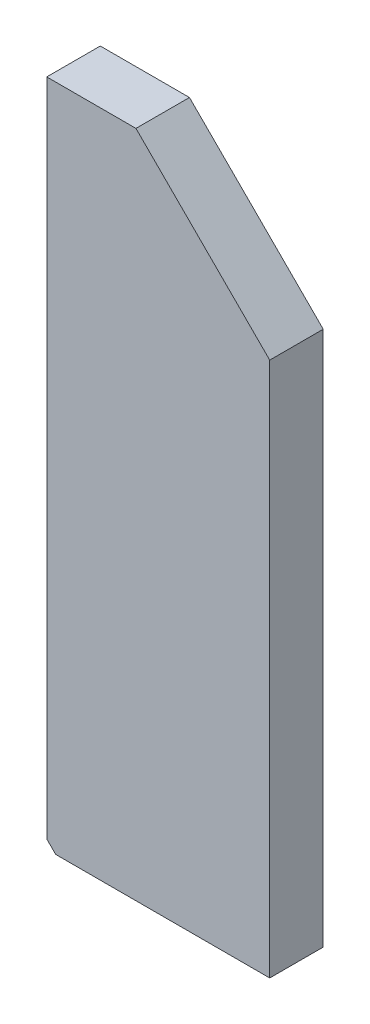
ISO-10303-21;
HEADER;
FILE_DESCRIPTION(('STEP AP214'),'2;1');
FILE_NAME('part.step','',(''),(''),'','','');
FILE_SCHEMA(('AUTOMOTIVE_DESIGN { 1 0 10303 214 1 1 1 1 }'));
ENDSEC;
DATA;
#1=APPLICATION_CONTEXT('core data for automotive mechanical design processes');
#2=APPLICATION_PROTOCOL_DEFINITION('international standard','automotive_design',2000,#1);
#3=PRODUCT_CONTEXT('',#1,'mechanical');
#4=PRODUCT('Part','Part','',(#3));
#5=PRODUCT_RELATED_PRODUCT_CATEGORY('part','',(#4));
#6=PRODUCT_DEFINITION_FORMATION('','',#4);
#7=PRODUCT_DEFINITION_CONTEXT('part definition',#1,'design');
#8=PRODUCT_DEFINITION('design','',#6,#7);
#9=PRODUCT_DEFINITION_SHAPE('','',#8);
#10=(LENGTH_UNIT() NAMED_UNIT(*) SI_UNIT(.MILLI.,.METRE.));
#11=(NAMED_UNIT(*) PLANE_ANGLE_UNIT() SI_UNIT($,.RADIAN.));
#12=(NAMED_UNIT(*) SI_UNIT($,.STERADIAN.) SOLID_ANGLE_UNIT());
#13=UNCERTAINTY_MEASURE_WITH_UNIT(LENGTH_MEASURE(1.E-05),#10,'distance_accuracy_value','');
#14=(GEOMETRIC_REPRESENTATION_CONTEXT(3) GLOBAL_UNCERTAINTY_ASSIGNED_CONTEXT((#13)) GLOBAL_UNIT_ASSIGNED_CONTEXT((#10,
#11,#12)) REPRESENTATION_CONTEXT('',''));
#15=CARTESIAN_POINT('',(0.,0.,0.));
#16=DIRECTION('',(0.,0.,1.));
#17=DIRECTION('',(1.,0.,0.));
#18=AXIS2_PLACEMENT_3D('',#15,#16,#17);
#19=CARTESIAN_POINT('',(-2.49999999999997,113.28125,12.));
#20=DIRECTION('',(-1.,0.,0.));
#21=DIRECTION('',(0.,0.,1.));
#22=AXIS2_PLACEMENT_3D('',#19,#20,#21);
#23=PLANE('',#22);
#24=DIRECTION('',(0.,1.,0.));
#25=VECTOR('',#24,1.);
#26=CARTESIAN_POINT('',(-2.49999999999997,113.28125,0.));
#27=LINE('',#26,#25);
#28=CARTESIAN_POINT('',(-2.49999999999997,-36.71875,0.));
#29=VERTEX_POINT('',#28);
#30=CARTESIAN_POINT('',(-2.49999999999997,83.2812499999999,0.));
#31=VERTEX_POINT('',#30);
#32=EDGE_CURVE('E140',#29,#31,#27,.T.);
#33=ORIENTED_EDGE('',*,*,#32,.T.);
#34=DIRECTION('',(0.,0.,1.));
#35=VECTOR('',#34,1.);
#36=CARTESIAN_POINT('',(-2.49999999999997,83.2812499999999,12.));
#37=LINE('',#36,#35);
#38=CARTESIAN_POINT('',(-2.49999999999997,83.2812499999999,12.));
#39=VERTEX_POINT('',#38);
#40=EDGE_CURVE('E169',#31,#39,#37,.T.);
#41=ORIENTED_EDGE('',*,*,#40,.T.);
#42=DIRECTION('',(0.,1.,0.));
#43=VECTOR('',#42,1.);
#44=CARTESIAN_POINT('',(-2.49999999999997,113.28125,12.));
#45=LINE('',#44,#43);
#46=CARTESIAN_POINT('',(-2.49999999999997,-36.71875,12.));
#47=VERTEX_POINT('',#46);
#48=EDGE_CURVE('E141',#47,#39,#45,.T.);
#49=ORIENTED_EDGE('',*,*,#48,.F.);
#50=DIRECTION('',(0.,0.,-1.));
#51=VECTOR('',#50,1.);
#52=CARTESIAN_POINT('',(-2.49999999999997,-36.71875,12.));
#53=LINE('',#52,#51);
#54=EDGE_CURVE('E151',#47,#29,#53,.T.);
#55=ORIENTED_EDGE('',*,*,#54,.T.);
#56=EDGE_LOOP('',(#33,#41,#49,#55));
#57=FACE_BOUND('',#56,.T.);
#58=ADVANCED_FACE('F35',(#57),#23,.F.);
#59=CARTESIAN_POINT('',(-52.5,113.28125,12.));
#60=DIRECTION('',(0.,-1.,0.));
#61=DIRECTION('',(1.,0.,0.));
#62=AXIS2_PLACEMENT_3D('',#59,#60,#61);
#63=PLANE('',#62);
#64=DIRECTION('',(-1.,0.,0.));
#65=VECTOR('',#64,1.);
#66=CARTESIAN_POINT('',(-52.5,113.28125,12.));
#67=LINE('',#66,#65);
#68=CARTESIAN_POINT('',(-32.5,113.28125,12.));
#69=VERTEX_POINT('',#68);
#70=CARTESIAN_POINT('',(-52.5,113.28125,12.));
#71=VERTEX_POINT('',#70);
#72=EDGE_CURVE('E144',#69,#71,#67,.T.);
#73=ORIENTED_EDGE('',*,*,#72,.F.);
#74=DIRECTION('',(0.,0.,-1.));
#75=VECTOR('',#74,1.);
#76=CARTESIAN_POINT('',(-32.5,113.28125,12.));
#77=LINE('',#76,#75);
#78=CARTESIAN_POINT('',(-32.5,113.28125,0.));
#79=VERTEX_POINT('',#78);
#80=EDGE_CURVE('E164',#69,#79,#77,.T.);
#81=ORIENTED_EDGE('',*,*,#80,.T.);
#82=DIRECTION('',(-1.,0.,0.));
#83=VECTOR('',#82,1.);
#84=CARTESIAN_POINT('',(-52.5,113.28125,0.));
#85=LINE('',#84,#83);
#86=CARTESIAN_POINT('',(-52.5,113.28125,0.));
#87=VERTEX_POINT('',#86);
#88=EDGE_CURVE('E154',#79,#87,#85,.T.);
#89=ORIENTED_EDGE('',*,*,#88,.T.);
#90=DIRECTION('',(0.,0.,-1.));
#91=VECTOR('',#90,1.);
#92=CARTESIAN_POINT('',(-52.5,113.28125,12.));
#93=LINE('',#92,#91);
#94=EDGE_CURVE('E161',#71,#87,#93,.T.);
#95=ORIENTED_EDGE('',*,*,#94,.F.);
#96=EDGE_LOOP('',(#73,#81,#89,#95));
#97=FACE_BOUND('',#96,.T.);
#98=ADVANCED_FACE('F198',(#97),#63,.F.);
#99=CARTESIAN_POINT('',(-52.5,113.28125,12.));
#100=DIRECTION('',(1.,0.,0.));
#101=DIRECTION('',(0.,1.,0.));
#102=AXIS2_PLACEMENT_3D('',#99,#100,#101);
#103=PLANE('',#102);
#104=CARTESIAN_POINT('',(-52.5,98.28125,6.));
#105=DIRECTION('',(-1.,0.,0.));
#106=DIRECTION('',(0.,0.,1.));
#107=AXIS2_PLACEMENT_3D('',#104,#105,#106);
#108=CIRCLE('',#107,2.1);
#109=CARTESIAN_POINT('',(-52.5,98.28125,8.1));
#110=VERTEX_POINT('',#109);
#111=EDGE_CURVE('E122',#110,#110,#108,.T.);
#112=ORIENTED_EDGE('',*,*,#111,.F.);
#113=EDGE_LOOP('',(#112));
#114=FACE_BOUND('',#113,.T.);
#115=CARTESIAN_POINT('',(-52.5,43.28125,6.));
#116=DIRECTION('',(-1.,0.,0.));
#117=DIRECTION('',(0.,0.,1.));
#118=AXIS2_PLACEMENT_3D('',#115,#116,#117);
#119=CIRCLE('',#118,2.1);
#120=CARTESIAN_POINT('',(-52.5,43.28125,8.1));
#121=VERTEX_POINT('',#120);
#122=EDGE_CURVE('E128',#121,#121,#119,.T.);
#123=ORIENTED_EDGE('',*,*,#122,.F.);
#124=EDGE_LOOP('',(#123));
#125=FACE_BOUND('',#124,.T.);
#126=CARTESIAN_POINT('',(-52.5,-11.71875,6.));
#127=DIRECTION('',(-1.,0.,0.));
#128=DIRECTION('',(0.,0.,1.));
#129=AXIS2_PLACEMENT_3D('',#126,#127,#128);
#130=CIRCLE('',#129,2.1);
#131=CARTESIAN_POINT('',(-52.5,-11.71875,8.1));
#132=VERTEX_POINT('',#131);
#133=EDGE_CURVE('E134',#132,#132,#130,.T.);
#134=ORIENTED_EDGE('',*,*,#133,.F.);
#135=EDGE_LOOP('',(#134));
#136=FACE_BOUND('',#135,.T.);
#137=DIRECTION('',(0.,-1.,0.));
#138=VECTOR('',#137,1.);
#139=CARTESIAN_POINT('',(-52.5,113.28125,0.));
#140=LINE('',#139,#138);
#141=CARTESIAN_POINT('',(-52.5,-34.71875,0.));
#142=VERTEX_POINT('',#141);
#143=EDGE_CURVE('E156',#87,#142,#140,.T.);
#144=ORIENTED_EDGE('',*,*,#143,.T.);
#145=DIRECTION('',(0.,0.,1.));
#146=VECTOR('',#145,1.);
#147=CARTESIAN_POINT('',(-52.5,-34.71875,12.));
#148=LINE('',#147,#146);
#149=CARTESIAN_POINT('',(-52.5,-34.71875,12.));
#150=VERTEX_POINT('',#149);
#151=EDGE_CURVE('E43',#142,#150,#148,.T.);
#152=ORIENTED_EDGE('',*,*,#151,.T.);
#153=DIRECTION('',(0.,-1.,0.));
#154=VECTOR('',#153,1.);
#155=CARTESIAN_POINT('',(-52.5,113.28125,12.));
#156=LINE('',#155,#154);
#157=EDGE_CURVE('E147',#71,#150,#156,.T.);
#158=ORIENTED_EDGE('',*,*,#157,.F.);
#159=ORIENTED_EDGE('',*,*,#94,.T.);
#160=EDGE_LOOP('',(#144,#152,#158,#159));
#161=FACE_BOUND('',#160,.T.);
#162=ADVANCED_FACE('F199',(#114,#125,#136,#161),#103,.F.);
#163=CARTESIAN_POINT('',(-52.5,-36.71875,12.));
#164=DIRECTION('',(0.,1.,0.));
#165=DIRECTION('',(0.,0.,1.));
#166=AXIS2_PLACEMENT_3D('',#163,#164,#165);
#167=PLANE('',#166);
#168=CARTESIAN_POINT('',(-46.5,-36.71875,6.));
#169=DIRECTION('',(0.,-1.,0.));
#170=DIRECTION('',(0.,0.,-1.));
#171=AXIS2_PLACEMENT_3D('',#168,#169,#170);
#172=CIRCLE('',#171,2.09999999999999);
#173=CARTESIAN_POINT('',(-46.5,-36.71875,3.90000000000001));
#174=VERTEX_POINT('',#173);
#175=EDGE_CURVE('E112',#174,#174,#172,.T.);
#176=ORIENTED_EDGE('',*,*,#175,.F.);
#177=EDGE_LOOP('',(#176));
#178=FACE_BOUND('',#177,.T.);
#179=CARTESIAN_POINT('',(-8.49999999999997,-36.71875,6.));
#180=DIRECTION('',(0.,-1.,0.));
#181=DIRECTION('',(0.,0.,-1.));
#182=AXIS2_PLACEMENT_3D('',#179,#180,#181);
#183=CIRCLE('',#182,2.09999999999999);
#184=CARTESIAN_POINT('',(-8.49999999999997,-36.71875,3.90000000000001));
#185=VERTEX_POINT('',#184);
#186=EDGE_CURVE('E111',#185,#185,#183,.T.);
#187=ORIENTED_EDGE('',*,*,#186,.F.);
#188=EDGE_LOOP('',(#187));
#189=FACE_BOUND('',#188,.T.);
#190=DIRECTION('',(1.,0.,0.));
#191=VECTOR('',#190,1.);
#192=CARTESIAN_POINT('',(-52.5,-36.71875,12.));
#193=LINE('',#192,#191);
#194=CARTESIAN_POINT('',(-50.5,-36.71875,12.));
#195=VERTEX_POINT('',#194);
#196=EDGE_CURVE('E149',#195,#47,#193,.T.);
#197=ORIENTED_EDGE('',*,*,#196,.F.);
#198=DIRECTION('',(0.,0.,-1.));
#199=VECTOR('',#198,1.);
#200=CARTESIAN_POINT('',(-50.5,-36.71875,12.));
#201=LINE('',#200,#199);
#202=CARTESIAN_POINT('',(-50.5,-36.71875,0.));
#203=VERTEX_POINT('',#202);
#204=EDGE_CURVE('E173',#195,#203,#201,.T.);
#205=ORIENTED_EDGE('',*,*,#204,.T.);
#206=DIRECTION('',(1.,0.,0.));
#207=VECTOR('',#206,1.);
#208=CARTESIAN_POINT('',(-52.5,-36.71875,0.));
#209=LINE('',#208,#207);
#210=EDGE_CURVE('E145',#203,#29,#209,.T.);
#211=ORIENTED_EDGE('',*,*,#210,.T.);
#212=ORIENTED_EDGE('',*,*,#54,.F.);
#213=EDGE_LOOP('',(#197,#205,#211,#212));
#214=FACE_BOUND('',#213,.T.);
#215=ADVANCED_FACE('F179',(#178,#189,#214),#167,.F.);
#216=CARTESIAN_POINT('',(0.,0.,12.));
#217=DIRECTION('',(0.,0.,1.));
#218=DIRECTION('',(1.,0.,0.));
#219=AXIS2_PLACEMENT_3D('',#216,#217,#218);
#220=PLANE('',#219);
#221=ORIENTED_EDGE('',*,*,#157,.T.);
#222=DIRECTION('',(-0.707106781186543,0.707106781186552,0.));
#223=VECTOR('',#222,1.);
#224=CARTESIAN_POINT('',(-43.6093750000003,-43.6093749999997,12.));
#225=LINE('',#224,#223);
#226=EDGE_CURVE('E11',#150,#195,#225,.F.);
#227=ORIENTED_EDGE('',*,*,#226,.T.);
#228=ORIENTED_EDGE('',*,*,#196,.T.);
#229=ORIENTED_EDGE('',*,*,#48,.T.);
#230=DIRECTION('',(0.707106781186546,-0.707106781186549,0.));
#231=VECTOR('',#230,1.);
#232=CARTESIAN_POINT('',(40.3906249999999,40.3906249999998,12.));
#233=LINE('',#232,#231);
#234=EDGE_CURVE('E171',#39,#69,#233,.F.);
#235=ORIENTED_EDGE('',*,*,#234,.T.);
#236=ORIENTED_EDGE('',*,*,#72,.T.);
#237=EDGE_LOOP('',(#221,#227,#228,#229,#235,#236));
#238=FACE_BOUND('',#237,.T.);
#239=ADVANCED_FACE('F195',(#238),#220,.T.);
#240=CARTESIAN_POINT('',(0.,0.,0.));
#241=DIRECTION('',(0.,0.,1.));
#242=DIRECTION('',(1.,0.,0.));
#243=AXIS2_PLACEMENT_3D('',#240,#241,#242);
#244=PLANE('',#243);
#245=ORIENTED_EDGE('',*,*,#210,.F.);
#246=DIRECTION('',(0.707106781186543,-0.707106781186552,0.));
#247=VECTOR('',#246,1.);
#248=CARTESIAN_POINT('',(-50.5,-36.71875,0.));
#249=LINE('',#248,#247);
#250=EDGE_CURVE('E57',#203,#142,#249,.F.);
#251=ORIENTED_EDGE('',*,*,#250,.T.);
#252=ORIENTED_EDGE('',*,*,#143,.F.);
#253=ORIENTED_EDGE('',*,*,#88,.F.);
#254=DIRECTION('',(-0.707106781186546,0.707106781186549,0.));
#255=VECTOR('',#254,1.);
#256=CARTESIAN_POINT('',(-32.5,113.28125,0.));
#257=LINE('',#256,#255);
#258=EDGE_CURVE('E167',#79,#31,#257,.F.);
#259=ORIENTED_EDGE('',*,*,#258,.T.);
#260=ORIENTED_EDGE('',*,*,#32,.F.);
#261=EDGE_LOOP('',(#245,#251,#252,#253,#259,#260));
#262=FACE_BOUND('',#261,.T.);
#263=ADVANCED_FACE('F184',(#262),#244,.F.);
#264=CARTESIAN_POINT('',(-42.5,-11.71875,6.));
#265=DIRECTION('',(-1.,0.,0.));
#266=DIRECTION('',(0.,0.,1.));
#267=AXIS2_PLACEMENT_3D('',#264,#265,#266);
#268=CONICAL_SURFACE('',#267,2.1,1.02974425867665);
#269=CARTESIAN_POINT('',(-41.2381927000421,-11.71875,6.));
#270=VERTEX_POINT('',#269);
#271=VERTEX_LOOP('',#270);
#272=FACE_BOUND('',#271,.T.);
#273=CARTESIAN_POINT('',(-42.5,-11.71875,6.));
#274=DIRECTION('',(-1.,0.,0.));
#275=DIRECTION('',(0.,0.,1.));
#276=AXIS2_PLACEMENT_3D('',#273,#274,#275);
#277=CIRCLE('',#276,2.1);
#278=CARTESIAN_POINT('',(-42.5,-11.71875,8.1));
#279=VERTEX_POINT('',#278);
#280=EDGE_CURVE('E137',#279,#279,#277,.T.);
#281=ORIENTED_EDGE('',*,*,#280,.T.);
#282=EDGE_LOOP('',(#281));
#283=FACE_BOUND('',#282,.T.);
#284=ADVANCED_FACE('F219',(#272,#283),#268,.F.);
#285=CARTESIAN_POINT('',(-52.5,-11.71875,6.));
#286=DIRECTION('',(-1.,0.,0.));
#287=DIRECTION('',(0.,0.,1.));
#288=AXIS2_PLACEMENT_3D('',#285,#286,#287);
#289=CYLINDRICAL_SURFACE('',#288,2.1);
#290=ORIENTED_EDGE('',*,*,#280,.F.);
#291=EDGE_LOOP('',(#290));
#292=FACE_BOUND('',#291,.T.);
#293=ORIENTED_EDGE('',*,*,#133,.T.);
#294=EDGE_LOOP('',(#293));
#295=FACE_BOUND('',#294,.T.);
#296=ADVANCED_FACE('F224',(#292,#295),#289,.F.);
#297=CARTESIAN_POINT('',(-42.5,43.28125,6.));
#298=DIRECTION('',(-1.,0.,0.));
#299=DIRECTION('',(0.,0.,1.));
#300=AXIS2_PLACEMENT_3D('',#297,#298,#299);
#301=CONICAL_SURFACE('',#300,2.1,1.02974425867665);
#302=CARTESIAN_POINT('',(-41.2381927000421,43.28125,6.));
#303=VERTEX_POINT('',#302);
#304=VERTEX_LOOP('',#303);
#305=FACE_BOUND('',#304,.T.);
#306=CARTESIAN_POINT('',(-42.5,43.28125,6.));
#307=DIRECTION('',(-1.,0.,0.));
#308=DIRECTION('',(0.,0.,1.));
#309=AXIS2_PLACEMENT_3D('',#306,#307,#308);
#310=CIRCLE('',#309,2.1);
#311=CARTESIAN_POINT('',(-42.5,43.28125,8.1));
#312=VERTEX_POINT('',#311);
#313=EDGE_CURVE('E131',#312,#312,#310,.T.);
#314=ORIENTED_EDGE('',*,*,#313,.T.);
#315=EDGE_LOOP('',(#314));
#316=FACE_BOUND('',#315,.T.);
#317=ADVANCED_FACE('F228',(#305,#316),#301,.F.);
#318=CARTESIAN_POINT('',(-52.5,43.28125,6.));
#319=DIRECTION('',(-1.,0.,0.));
#320=DIRECTION('',(0.,0.,1.));
#321=AXIS2_PLACEMENT_3D('',#318,#319,#320);
#322=CYLINDRICAL_SURFACE('',#321,2.1);
#323=ORIENTED_EDGE('',*,*,#313,.F.);
#324=EDGE_LOOP('',(#323));
#325=FACE_BOUND('',#324,.T.);
#326=ORIENTED_EDGE('',*,*,#122,.T.);
#327=EDGE_LOOP('',(#326));
#328=FACE_BOUND('',#327,.T.);
#329=ADVANCED_FACE('F232',(#325,#328),#322,.F.);
#330=CARTESIAN_POINT('',(-42.5,98.28125,6.));
#331=DIRECTION('',(-1.,0.,0.));
#332=DIRECTION('',(0.,0.,1.));
#333=AXIS2_PLACEMENT_3D('',#330,#331,#332);
#334=CONICAL_SURFACE('',#333,2.09999999999999,1.02974425867665);
#335=CARTESIAN_POINT('',(-41.2381927000421,98.28125,6.));
#336=VERTEX_POINT('',#335);
#337=VERTEX_LOOP('',#336);
#338=FACE_BOUND('',#337,.T.);
#339=CARTESIAN_POINT('',(-42.5,98.28125,6.));
#340=DIRECTION('',(-1.,0.,0.));
#341=DIRECTION('',(0.,0.,1.));
#342=AXIS2_PLACEMENT_3D('',#339,#340,#341);
#343=CIRCLE('',#342,2.09999999999999);
#344=CARTESIAN_POINT('',(-42.5,98.28125,8.09999999999999));
#345=VERTEX_POINT('',#344);
#346=EDGE_CURVE('E125',#345,#345,#343,.T.);
#347=ORIENTED_EDGE('',*,*,#346,.T.);
#348=EDGE_LOOP('',(#347));
#349=FACE_BOUND('',#348,.T.);
#350=ADVANCED_FACE('F236',(#338,#349),#334,.F.);
#351=CARTESIAN_POINT('',(-52.5,98.28125,6.));
#352=DIRECTION('',(-1.,0.,0.));
#353=DIRECTION('',(0.,0.,1.));
#354=AXIS2_PLACEMENT_3D('',#351,#352,#353);
#355=CYLINDRICAL_SURFACE('',#354,2.1);
#356=ORIENTED_EDGE('',*,*,#346,.F.);
#357=EDGE_LOOP('',(#356));
#358=FACE_BOUND('',#357,.T.);
#359=ORIENTED_EDGE('',*,*,#111,.T.);
#360=EDGE_LOOP('',(#359));
#361=FACE_BOUND('',#360,.T.);
#362=ADVANCED_FACE('F240',(#358,#361),#355,.F.);
#363=CARTESIAN_POINT('',(-8.49999999999997,-26.71875,6.));
#364=DIRECTION('',(0.,-1.,0.));
#365=DIRECTION('',(0.,0.,-1.));
#366=AXIS2_PLACEMENT_3D('',#363,#364,#365);
#367=CONICAL_SURFACE('',#366,2.1,1.02974425867665);
#368=CARTESIAN_POINT('',(-8.49999999999998,-25.4569427000421,6.));
#369=VERTEX_POINT('',#368);
#370=VERTEX_LOOP('',#369);
#371=FACE_BOUND('',#370,.T.);
#372=CARTESIAN_POINT('',(-8.49999999999997,-26.71875,6.));
#373=DIRECTION('',(0.,-1.,0.));
#374=DIRECTION('',(0.,0.,-1.));
#375=AXIS2_PLACEMENT_3D('',#372,#373,#374);
#376=CIRCLE('',#375,2.1);
#377=CARTESIAN_POINT('',(-8.49999999999997,-26.71875,3.9));
#378=VERTEX_POINT('',#377);
#379=EDGE_CURVE('E115',#378,#378,#376,.T.);
#380=ORIENTED_EDGE('',*,*,#379,.T.);
#381=EDGE_LOOP('',(#380));
#382=FACE_BOUND('',#381,.T.);
#383=ADVANCED_FACE('F244',(#371,#382),#367,.F.);
#384=CARTESIAN_POINT('',(-8.49999999999997,-36.71875,6.));
#385=DIRECTION('',(0.,-1.,0.));
#386=DIRECTION('',(0.,0.,-1.));
#387=AXIS2_PLACEMENT_3D('',#384,#385,#386);
#388=CYLINDRICAL_SURFACE('',#387,2.09999999999999);
#389=ORIENTED_EDGE('',*,*,#379,.F.);
#390=EDGE_LOOP('',(#389));
#391=FACE_BOUND('',#390,.T.);
#392=ORIENTED_EDGE('',*,*,#186,.T.);
#393=EDGE_LOOP('',(#392));
#394=FACE_BOUND('',#393,.T.);
#395=ADVANCED_FACE('F105',(#391,#394),#388,.F.);
#396=CARTESIAN_POINT('',(-46.5,-26.71875,6.));
#397=DIRECTION('',(0.,-1.,0.));
#398=DIRECTION('',(0.,0.,-1.));
#399=AXIS2_PLACEMENT_3D('',#396,#397,#398);
#400=CONICAL_SURFACE('',#399,2.1,1.02974425867665);
#401=CARTESIAN_POINT('',(-46.5,-25.4569427000421,6.));
#402=VERTEX_POINT('',#401);
#403=VERTEX_LOOP('',#402);
#404=FACE_BOUND('',#403,.T.);
#405=CARTESIAN_POINT('',(-46.5,-26.71875,6.));
#406=DIRECTION('',(0.,-1.,0.));
#407=DIRECTION('',(0.,0.,-1.));
#408=AXIS2_PLACEMENT_3D('',#405,#406,#407);
#409=CIRCLE('',#408,2.1);
#410=CARTESIAN_POINT('',(-46.5,-26.71875,3.9));
#411=VERTEX_POINT('',#410);
#412=EDGE_CURVE('E109',#411,#411,#409,.T.);
#413=ORIENTED_EDGE('',*,*,#412,.T.);
#414=EDGE_LOOP('',(#413));
#415=FACE_BOUND('',#414,.T.);
#416=ADVANCED_FACE('F101',(#404,#415),#400,.F.);
#417=CARTESIAN_POINT('',(-46.5,-36.71875,6.));
#418=DIRECTION('',(0.,-1.,0.));
#419=DIRECTION('',(0.,0.,-1.));
#420=AXIS2_PLACEMENT_3D('',#417,#418,#419);
#421=CYLINDRICAL_SURFACE('',#420,2.09999999999999);
#422=ORIENTED_EDGE('',*,*,#412,.F.);
#423=EDGE_LOOP('',(#422));
#424=FACE_BOUND('',#423,.T.);
#425=ORIENTED_EDGE('',*,*,#175,.T.);
#426=EDGE_LOOP('',(#425));
#427=FACE_BOUND('',#426,.T.);
#428=ADVANCED_FACE('F104',(#424,#427),#421,.F.);
#429=CARTESIAN_POINT('',(-32.5,113.28125,12.));
#430=DIRECTION('',(-0.707106781186549,-0.707106781186546,0.));
#431=DIRECTION('',(0.,0.,-1.));
#432=AXIS2_PLACEMENT_3D('',#429,#430,#431);
#433=PLANE('',#432);
#434=ORIENTED_EDGE('',*,*,#234,.F.);
#435=ORIENTED_EDGE('',*,*,#40,.F.);
#436=ORIENTED_EDGE('',*,*,#258,.F.);
#437=ORIENTED_EDGE('',*,*,#80,.F.);
#438=EDGE_LOOP('',(#434,#435,#436,#437));
#439=FACE_BOUND('',#438,.T.);
#440=ADVANCED_FACE('F191',(#439),#433,.F.);
#441=CARTESIAN_POINT('',(-50.5,-36.71875,12.));
#442=DIRECTION('',(0.707106781186552,0.707106781186542,0.));
#443=DIRECTION('',(0.,0.,-1.));
#444=AXIS2_PLACEMENT_3D('',#441,#442,#443);
#445=PLANE('',#444);
#446=ORIENTED_EDGE('',*,*,#226,.F.);
#447=ORIENTED_EDGE('',*,*,#151,.F.);
#448=ORIENTED_EDGE('',*,*,#250,.F.);
#449=ORIENTED_EDGE('',*,*,#204,.F.);
#450=EDGE_LOOP('',(#446,#447,#448,#449));
#451=FACE_BOUND('',#450,.T.);
#452=ADVANCED_FACE('F37',(#451),#445,.F.);
#453=CLOSED_SHELL('',(#58,#98,#162,#215,#239,#263,#284,#296,#317,#329,#350,#362,#383,#395,#416,
#428,#440,#452));
#454=MANIFOLD_SOLID_BREP('B2',#453);
#455=ADVANCED_BREP_SHAPE_REPRESENTATION('',(#18,#454),#14);
#456=SHAPE_DEFINITION_REPRESENTATION(#9,#455);
ENDSEC;
END-ISO-10303-21;
